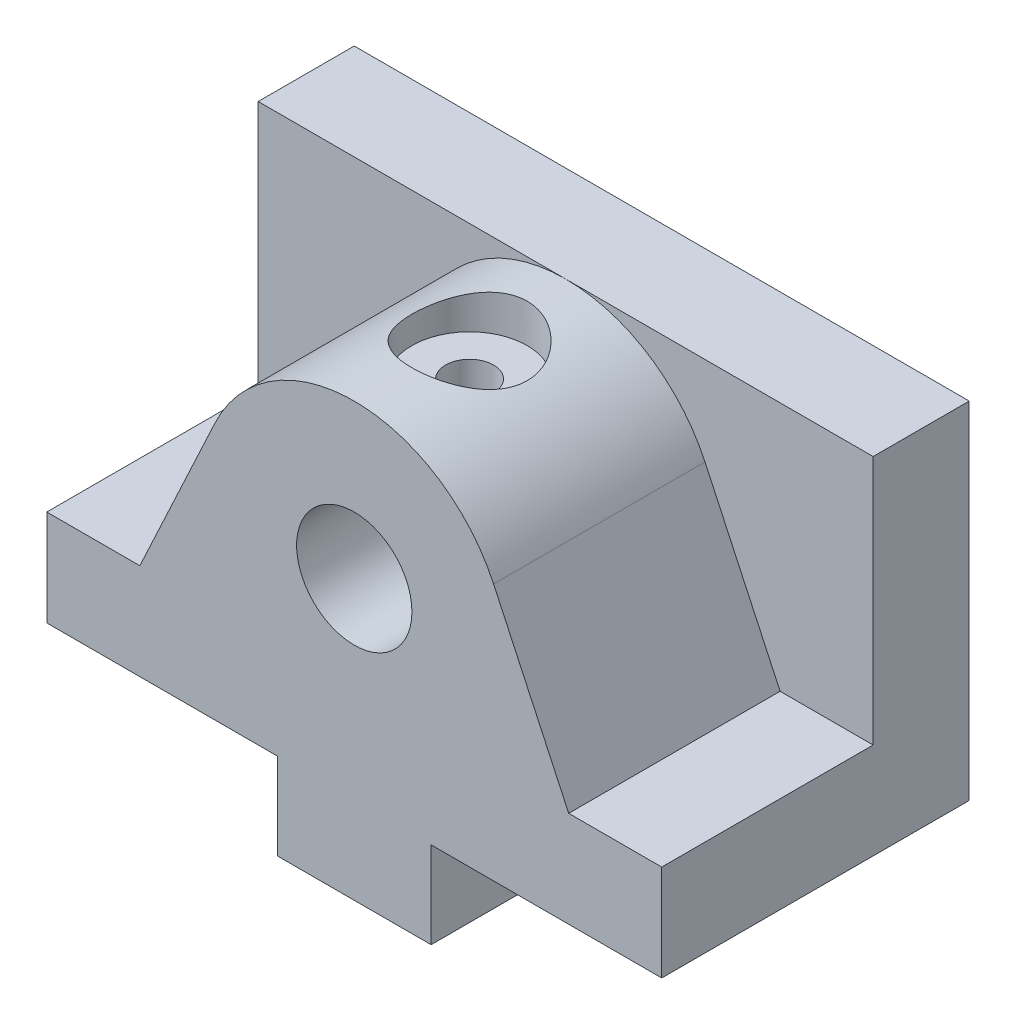
ISO-10303-21;
HEADER;
FILE_DESCRIPTION(('STEP AP214'),'2;1');
FILE_NAME('part.step','',(''),(''),'','','');
FILE_SCHEMA(('AUTOMOTIVE_DESIGN { 1 0 10303 214 1 1 1 1 }'));
ENDSEC;
DATA;
#1=APPLICATION_CONTEXT('core data for automotive mechanical design processes');
#2=APPLICATION_PROTOCOL_DEFINITION('international standard','automotive_design',2000,#1);
#3=PRODUCT_CONTEXT('',#1,'mechanical');
#4=PRODUCT('Part','Part','',(#3));
#5=PRODUCT_RELATED_PRODUCT_CATEGORY('part','',(#4));
#6=PRODUCT_DEFINITION_FORMATION('','',#4);
#7=PRODUCT_DEFINITION_CONTEXT('part definition',#1,'design');
#8=PRODUCT_DEFINITION('design','',#6,#7);
#9=PRODUCT_DEFINITION_SHAPE('','',#8);
#10=(LENGTH_UNIT() NAMED_UNIT(*) SI_UNIT(.MILLI.,.METRE.));
#11=(NAMED_UNIT(*) PLANE_ANGLE_UNIT() SI_UNIT($,.RADIAN.));
#12=(NAMED_UNIT(*) SI_UNIT($,.STERADIAN.) SOLID_ANGLE_UNIT());
#13=UNCERTAINTY_MEASURE_WITH_UNIT(LENGTH_MEASURE(1.E-05),#10,'distance_accuracy_value','');
#14=(GEOMETRIC_REPRESENTATION_CONTEXT(3) GLOBAL_UNCERTAINTY_ASSIGNED_CONTEXT((#13)) GLOBAL_UNIT_ASSIGNED_CONTEXT((#10,
#11,#12)) REPRESENTATION_CONTEXT('',''));
#15=CARTESIAN_POINT('',(0.,0.,0.));
#16=DIRECTION('',(0.,0.,1.));
#17=DIRECTION('',(1.,0.,0.));
#18=AXIS2_PLACEMENT_3D('',#15,#16,#17);
#19=CARTESIAN_POINT('',(0.,45.,20.));
#20=DIRECTION('',(0.,1.,0.));
#21=DIRECTION('',(0.,0.,1.));
#22=AXIS2_PLACEMENT_3D('',#19,#20,#21);
#23=CYLINDRICAL_SURFACE('',#22,2.49999999999999);
#24=CARTESIAN_POINT('',(0.,35.,22.5));
#25=CARTESIAN_POINT('',(0.13390391816379,34.9999962829091,22.4999952878604));
#26=CARTESIAN_POINT('',(0.268039524991423,34.9954665682116,22.4891786843995));
#27=CARTESIAN_POINT('',(0.532498019991111,34.9778011578862,22.4463192619064));
#28=CARTESIAN_POINT('',(0.662810029808667,34.9646430059979,22.4142210532185));
#29=CARTESIAN_POINT('',(0.915376593299221,34.9311262910601,22.3301785119407));
#30=CARTESIAN_POINT('',(1.03765681434384,34.9107921364203,22.2783014076769));
#31=CARTESIAN_POINT('',(1.27165974779732,34.8649055925345,22.1564541669781));
#32=CARTESIAN_POINT('',(1.38338564416287,34.8393547844135,22.0864895110252));
#33=CARTESIAN_POINT('',(1.59889674004596,34.7841566061986,21.9267420881924));
#34=CARTESIAN_POINT('',(1.70208251703041,34.7543750770343,21.8361973967483));
#35=CARTESIAN_POINT('',(1.89231966019709,34.6946542708523,21.6394713160995));
#36=CARTESIAN_POINT('',(1.97936253123989,34.6647149192556,21.5332817462849));
#37=CARTESIAN_POINT('',(2.13907474876482,34.6064204392822,21.3019464489895));
#38=CARTESIAN_POINT('',(2.21082616169409,34.578215738276,21.1761251042486));
#39=CARTESIAN_POINT('',(2.33187881316099,34.5287114463322,20.9128534830571));
#40=CARTESIAN_POINT('',(2.38119161708798,34.507408299805,20.7754092407429));
#41=CARTESIAN_POINT('',(2.45349196589844,34.4755711079554,20.4996926167385));
#42=CARTESIAN_POINT('',(2.47763315746,34.4645677530895,20.361779033289));
#43=CARTESIAN_POINT('',(2.50250419944797,34.4532265243363,20.0834534145536));
#44=CARTESIAN_POINT('',(2.50324696111169,34.4528827684913,19.9430427999296));
#45=CARTESIAN_POINT('',(2.48216900725154,34.4625023912299,19.6751998791476));
#46=CARTESIAN_POINT('',(2.46207362224013,34.4716776544759,19.5475978068758));
#47=CARTESIAN_POINT('',(2.4027838203214,34.4979696554725,19.2977758179945));
#48=CARTESIAN_POINT('',(2.36358574574512,34.5150879140703,19.1755569370152));
#49=CARTESIAN_POINT('',(2.26643917454978,34.5557236954561,18.9368845940184));
#50=CARTESIAN_POINT('',(2.20810943078427,34.579369638983,18.8206091581736));
#51=CARTESIAN_POINT('',(2.07462485161168,34.6303666228215,18.5990445322394));
#52=CARTESIAN_POINT('',(1.9994633810392,34.6577191225955,18.4937596987729));
#53=CARTESIAN_POINT('',(1.82699193108753,34.7158595375597,18.2878000825344));
#54=CARTESIAN_POINT('',(1.72834696641501,34.7467424280895,18.1882668652292));
#55=CARTESIAN_POINT('',(1.51545918210305,34.8065134622506,18.0067729940816));
#56=CARTESIAN_POINT('',(1.40121271889692,34.8354011375402,17.9248164566156));
#57=CARTESIAN_POINT('',(1.15689589738674,34.8887656711295,17.7791283527675));
#58=CARTESIAN_POINT('',(1.02652116489535,34.9131253308667,17.7158611096986));
#59=CARTESIAN_POINT('',(0.755704805053663,34.9537896282961,17.6125577207935));
#60=CARTESIAN_POINT('',(0.615268789590068,34.970098716916,17.5725087361124));
#61=CARTESIAN_POINT('',(0.337856226692454,34.9919928237277,17.5191680157467));
#62=CARTESIAN_POINT('',(0.201222570557276,34.9981908209425,17.5043442851125));
#63=CARTESIAN_POINT('',(-0.0727093109921786,35.0011210073749,17.4973075527718));
#64=CARTESIAN_POINT('',(-0.21000733430527,34.9978559142388,17.505088059496));
#65=CARTESIAN_POINT('',(-0.47419648468287,34.9826243531388,17.5419421696121));
#66=CARTESIAN_POINT('',(-0.601265933278774,34.9710977456798,17.5699399081944));
#67=CARTESIAN_POINT('',(-0.848765497942176,34.9409721354483,17.6449363890816));
#68=CARTESIAN_POINT('',(-0.969194773036709,34.9223722391941,17.6919375319006));
#69=CARTESIAN_POINT('',(-1.20421799973828,34.8791654129033,17.8051419514242));
#70=CARTESIAN_POINT('',(-1.31851447371068,34.8543898293856,17.871896366292));
#71=CARTESIAN_POINT('',(-1.53469243246282,34.8014760915818,18.0221067555834));
#72=CARTESIAN_POINT('',(-1.63656870520374,34.7733365353747,18.1055697030587));
#73=CARTESIAN_POINT('',(-1.83266686054867,34.7142417579087,18.2938064665447));
#74=CARTESIAN_POINT('',(-1.92582139596022,34.6832290318203,18.3996770059721));
#75=CARTESIAN_POINT('',(-2.09333969221046,34.6236867353604,18.6260425518712));
#76=CARTESIAN_POINT('',(-2.16769918571026,34.5951577298699,18.746540870345));
#77=CARTESIAN_POINT('',(-2.29631920417609,34.5436277248786,19.0012283506036));
#78=CARTESIAN_POINT('',(-2.3502783647545,34.520711251098,19.1355880710238));
#79=CARTESIAN_POINT('',(-2.43434827902352,34.4841671131833,19.4127411876261));
#80=CARTESIAN_POINT('',(-2.46447869724416,34.4705317911307,19.5555275249888));
#81=CARTESIAN_POINT('',(-2.49808160700531,34.4552632907308,19.8336373983781));
#82=CARTESIAN_POINT('',(-2.50342760836083,34.4527870192911,19.9686893245119));
#83=CARTESIAN_POINT('',(-2.49231151038,34.4578770602726,20.2376857223555));
#84=CARTESIAN_POINT('',(-2.47585275892878,34.4654418310001,20.3716303609001));
#85=CARTESIAN_POINT('',(-2.42316809595843,34.4889910258604,20.6281854946778));
#86=CARTESIAN_POINT('',(-2.38789807270202,34.5045670962545,20.7510333459775));
#87=CARTESIAN_POINT('',(-2.29952656276962,34.542063624659,20.989096043664));
#88=CARTESIAN_POINT('',(-2.24642006560088,34.5639858651503,21.104308734336));
#89=CARTESIAN_POINT('',(-2.12020572373919,34.6133390885325,21.331391788147));
#90=CARTESIAN_POINT('',(-2.04608723750135,34.6410220440408,21.4426446459478));
#91=CARTESIAN_POINT('',(-1.88136812596237,34.6980737913131,21.6517202931151));
#92=CARTESIAN_POINT('',(-1.79076178563714,34.7274431652004,21.7495384050324));
#93=CARTESIAN_POINT('',(-1.58780416898837,34.7871278159309,21.9362973056175));
#94=CARTESIAN_POINT('',(-1.47434977868812,34.8173561917501,22.0240726428278));
#95=CARTESIAN_POINT('',(-1.23319985958042,34.8732030309982,22.1793991300421));
#96=CARTESIAN_POINT('',(-1.10549787741689,34.8988193916017,22.2469410639968));
#97=CARTESIAN_POINT('',(-0.841465213422189,34.9421830837889,22.3584188704516));
#98=CARTESIAN_POINT('',(-0.705312056415863,34.9600534904466,22.4027264942901));
#99=CARTESIAN_POINT('',(-0.426816782070265,34.9864223497589,22.4674156875296));
#100=CARTESIAN_POINT('',(-0.284495506121987,34.9949501404242,22.4878721682058));
#101=CARTESIAN_POINT('',(-0.118052512349435,34.9988856661429,22.4973238417862));
#102=CARTESIAN_POINT('',(-0.0944569348794005,34.99930292615,22.498326602503));
#103=CARTESIAN_POINT('',(-0.0472433090693347,34.9998604213866,22.4996650982568));
#104=CARTESIAN_POINT('',(-0.0236252606651497,35.0000006558228,22.5000008313836));
#105=CARTESIAN_POINT('',(0.,35.,22.5));
#106=B_SPLINE_CURVE_WITH_KNOTS('',3,(#24,#25,#26,#27,#28,#29,#30,#31,#32,#33,#34,#35,#36,#37,
#38,#39,#40,#41,#42,#43,#44,#45,#46,#47,#48,#49,#50,#51,#52,#53,#54,#55,#56,#57,#58,#59,#60,#61,
#62,#63,#64,#65,#66,#67,#68,#69,#70,#71,#72,#73,#74,#75,#76,#77,#78,#79,#80,#81,#82,#83,#84,#85,
#86,#87,#88,#89,#90,#91,#92,#93,#94,#95,#96,#97,#98,#99,#100,#101,#102,#103,#104,#105),
.UNSPECIFIED.,.T.,.F.,(4,2,2,2,2,2,2,2,2,2,2,2,2,2,2,2,2,2,2,2,2,2,2,2,2,2,2,2,2,2,2,2,2,2,2,2,
2,2,2,2,4),(0.,0.401613837767876,0.804277081257389,1.2055837038126,1.60676887370594,
2.02635872577613,2.4461687626293,2.88663449078249,3.32687293461174,3.74590546275114,
4.16470676498091,4.55140314405112,4.93817359454424,5.33317426117427,5.72833091434411,
6.15688282255791,6.58553498629174,7.02408110121624,7.46238448436591,7.87296886786499,
8.28343534986341,8.6735317947144,9.06367753203567,9.46594270544319,9.86837610938989,
10.2995697605859,10.7308612248068,11.1682957671904,11.6053689414916,12.0087975511928,
12.4121642259507,12.7967529992952,13.1814498990122,13.5892778679488,13.9972474685188,
14.4349307000977,14.8728129885716,15.3034571163877,15.7327450093864,15.8036033125921,
15.8744618187068),.UNSPECIFIED.);
#107=CARTESIAN_POINT('',(0.,35.,22.5));
#108=VERTEX_POINT('',#107);
#109=EDGE_CURVE('E154',#108,#108,#106,.T.);
#110=ORIENTED_EDGE('',*,*,#109,.F.);
#111=EDGE_LOOP('',(#110));
#112=FACE_BOUND('',#111,.T.);
#113=CARTESIAN_POINT('',(0.,41.,20.));
#114=DIRECTION('',(0.,1.,0.));
#115=DIRECTION('',(0.,0.,1.));
#116=AXIS2_PLACEMENT_3D('',#113,#114,#115);
#117=CIRCLE('',#116,2.49999999999999);
#118=CARTESIAN_POINT('',(0.,41.,22.5));
#119=VERTEX_POINT('',#118);
#120=EDGE_CURVE('E162',#119,#119,#117,.F.);
#121=ORIENTED_EDGE('',*,*,#120,.F.);
#122=EDGE_LOOP('',(#121));
#123=FACE_BOUND('',#122,.T.);
#124=ADVANCED_FACE('F34',(#112,#123),#23,.F.);
#125=CARTESIAN_POINT('',(0.,0.,10.));
#126=DIRECTION('',(0.,0.,-1.));
#127=DIRECTION('',(-1.,0.,0.));
#128=AXIS2_PLACEMENT_3D('',#125,#126,#127);
#129=PLANE('',#128);
#130=DIRECTION('',(0.422618261740697,-0.906307787036651,0.));
#131=VECTOR('',#130,1.);
#132=CARTESIAN_POINT('',(25.6085690178115,11.9414718473963,10.));
#133=LINE('',#132,#131);
#134=CARTESIAN_POINT('',(14.5009245925864,35.7618921878512,10.));
#135=VERTEX_POINT('',#134);
#136=CARTESIAN_POINT('',(22.3171232849498,19.,10.));
#137=VERTEX_POINT('',#136);
#138=EDGE_CURVE('E218',#135,#137,#133,.T.);
#139=ORIENTED_EDGE('',*,*,#138,.T.);
#140=DIRECTION('',(1.,0.,0.));
#141=VECTOR('',#140,1.);
#142=CARTESIAN_POINT('',(0.,19.,10.));
#143=LINE('',#142,#141);
#144=CARTESIAN_POINT('',(32.,19.,10.));
#145=VERTEX_POINT('',#144);
#146=EDGE_CURVE('E259',#137,#145,#143,.T.);
#147=ORIENTED_EDGE('',*,*,#146,.T.);
#148=DIRECTION('',(0.,1.,0.));
#149=VECTOR('',#148,1.);
#150=CARTESIAN_POINT('',(32.,9.,10.));
#151=LINE('',#150,#149);
#152=CARTESIAN_POINT('',(32.,45.,10.));
#153=VERTEX_POINT('',#152);
#154=EDGE_CURVE('E276',#145,#153,#151,.T.);
#155=ORIENTED_EDGE('',*,*,#154,.T.);
#156=DIRECTION('',(-1.,0.,0.));
#157=VECTOR('',#156,1.);
#158=CARTESIAN_POINT('',(-32.,45.,10.));
#159=LINE('',#158,#157);
#160=CARTESIAN_POINT('',(0.,45.,10.));
#161=VERTEX_POINT('',#160);
#162=EDGE_CURVE('E113',#153,#161,#159,.T.);
#163=ORIENTED_EDGE('',*,*,#162,.T.);
#164=CARTESIAN_POINT('',(0.,29.,10.));
#165=DIRECTION('',(0.,0.,1.));
#166=DIRECTION('',(1.,0.,0.));
#167=AXIS2_PLACEMENT_3D('',#164,#165,#166);
#168=CIRCLE('',#167,16.);
#169=EDGE_CURVE('E47',#161,#135,#168,.F.);
#170=ORIENTED_EDGE('',*,*,#169,.T.);
#171=EDGE_LOOP('',(#139,#147,#155,#163,#170));
#172=FACE_BOUND('',#171,.T.);
#173=ADVANCED_FACE('F170',(#172),#129,.F.);
#174=CARTESIAN_POINT('',(-32.,9.,10.));
#175=DIRECTION('',(1.,0.,0.));
#176=DIRECTION('',(0.,0.,-1.));
#177=AXIS2_PLACEMENT_3D('',#174,#175,#176);
#178=PLANE('',#177);
#179=DIRECTION('',(0.,-1.,0.));
#180=VECTOR('',#179,1.);
#181=CARTESIAN_POINT('',(-32.,9.,0.));
#182=LINE('',#181,#180);
#183=CARTESIAN_POINT('',(-32.,45.,0.));
#184=VERTEX_POINT('',#183);
#185=CARTESIAN_POINT('',(-32.,9.,0.));
#186=VERTEX_POINT('',#185);
#187=EDGE_CURVE('E111',#184,#186,#182,.T.);
#188=ORIENTED_EDGE('',*,*,#187,.T.);
#189=DIRECTION('',(0.,0.,-1.));
#190=VECTOR('',#189,1.);
#191=CARTESIAN_POINT('',(-32.,9.,10.));
#192=LINE('',#191,#190);
#193=CARTESIAN_POINT('',(-32.,9.,32.));
#194=VERTEX_POINT('',#193);
#195=EDGE_CURVE('E152',#194,#186,#192,.T.);
#196=ORIENTED_EDGE('',*,*,#195,.F.);
#197=DIRECTION('',(0.,-1.,0.));
#198=VECTOR('',#197,1.);
#199=CARTESIAN_POINT('',(-32.,0.,32.));
#200=LINE('',#199,#198);
#201=CARTESIAN_POINT('',(-32.,19.,32.));
#202=VERTEX_POINT('',#201);
#203=EDGE_CURVE('E224',#202,#194,#200,.T.);
#204=ORIENTED_EDGE('',*,*,#203,.F.);
#205=DIRECTION('',(0.,0.,-1.));
#206=VECTOR('',#205,1.);
#207=CARTESIAN_POINT('',(-32.,19.,32.));
#208=LINE('',#207,#206);
#209=CARTESIAN_POINT('',(-32.,19.,10.));
#210=VERTEX_POINT('',#209);
#211=EDGE_CURVE('E272',#202,#210,#208,.T.);
#212=ORIENTED_EDGE('',*,*,#211,.T.);
#213=DIRECTION('',(0.,-1.,0.));
#214=VECTOR('',#213,1.);
#215=CARTESIAN_POINT('',(-32.,9.,10.));
#216=LINE('',#215,#214);
#217=CARTESIAN_POINT('',(-32.,45.,10.));
#218=VERTEX_POINT('',#217);
#219=EDGE_CURVE('E105',#218,#210,#216,.T.);
#220=ORIENTED_EDGE('',*,*,#219,.F.);
#221=DIRECTION('',(0.,0.,-1.));
#222=VECTOR('',#221,1.);
#223=CARTESIAN_POINT('',(-32.,45.,10.));
#224=LINE('',#223,#222);
#225=EDGE_CURVE('E97',#218,#184,#224,.T.);
#226=ORIENTED_EDGE('',*,*,#225,.T.);
#227=EDGE_LOOP('',(#188,#196,#204,#212,#220,#226));
#228=FACE_BOUND('',#227,.T.);
#229=ADVANCED_FACE('F36',(#228),#178,.F.);
#230=CARTESIAN_POINT('',(-32.,9.,10.));
#231=DIRECTION('',(0.,1.,0.));
#232=DIRECTION('',(-1.,0.,0.));
#233=AXIS2_PLACEMENT_3D('',#230,#231,#232);
#234=PLANE('',#233);
#235=DIRECTION('',(1.,0.,0.));
#236=VECTOR('',#235,1.);
#237=CARTESIAN_POINT('',(-32.,9.,0.));
#238=LINE('',#237,#236);
#239=CARTESIAN_POINT('',(-8.,9.00000000000001,0.));
#240=VERTEX_POINT('',#239);
#241=EDGE_CURVE('E117',#186,#240,#238,.T.);
#242=ORIENTED_EDGE('',*,*,#241,.T.);
#243=DIRECTION('',(0.,0.,-1.));
#244=VECTOR('',#243,1.);
#245=CARTESIAN_POINT('',(-8.,9.00000000000001,10.));
#246=LINE('',#245,#244);
#247=CARTESIAN_POINT('',(-8.,9.00000000000001,32.));
#248=VERTEX_POINT('',#247);
#249=EDGE_CURVE('E149',#248,#240,#246,.T.);
#250=ORIENTED_EDGE('',*,*,#249,.F.);
#251=DIRECTION('',(1.,0.,0.));
#252=VECTOR('',#251,1.);
#253=CARTESIAN_POINT('',(0.,9.00000000000001,32.));
#254=LINE('',#253,#252);
#255=EDGE_CURVE('E227',#194,#248,#254,.T.);
#256=ORIENTED_EDGE('',*,*,#255,.F.);
#257=ORIENTED_EDGE('',*,*,#195,.T.);
#258=EDGE_LOOP('',(#242,#250,#256,#257));
#259=FACE_BOUND('',#258,.T.);
#260=ADVANCED_FACE('F392',(#259),#234,.F.);
#261=CARTESIAN_POINT('',(-8.,9.00000000000001,10.));
#262=DIRECTION('',(1.,0.,0.));
#263=DIRECTION('',(0.,0.,-1.));
#264=AXIS2_PLACEMENT_3D('',#261,#262,#263);
#265=PLANE('',#264);
#266=DIRECTION('',(0.,-1.,0.));
#267=VECTOR('',#266,1.);
#268=CARTESIAN_POINT('',(-8.,9.00000000000001,0.));
#269=LINE('',#268,#267);
#270=CARTESIAN_POINT('',(-8.,0.,0.));
#271=VERTEX_POINT('',#270);
#272=EDGE_CURVE('E121',#240,#271,#269,.T.);
#273=ORIENTED_EDGE('',*,*,#272,.T.);
#274=DIRECTION('',(0.,0.,-1.));
#275=VECTOR('',#274,1.);
#276=CARTESIAN_POINT('',(-8.,0.,10.));
#277=LINE('',#276,#275);
#278=CARTESIAN_POINT('',(-8.,0.,32.));
#279=VERTEX_POINT('',#278);
#280=EDGE_CURVE('E146',#279,#271,#277,.T.);
#281=ORIENTED_EDGE('',*,*,#280,.F.);
#282=DIRECTION('',(0.,-1.,0.));
#283=VECTOR('',#282,1.);
#284=CARTESIAN_POINT('',(-8.,0.,32.));
#285=LINE('',#284,#283);
#286=EDGE_CURVE('E230',#248,#279,#285,.T.);
#287=ORIENTED_EDGE('',*,*,#286,.F.);
#288=ORIENTED_EDGE('',*,*,#249,.T.);
#289=EDGE_LOOP('',(#273,#281,#287,#288));
#290=FACE_BOUND('',#289,.T.);
#291=ADVANCED_FACE('F389',(#290),#265,.F.);
#292=CARTESIAN_POINT('',(-8.,0.,10.));
#293=DIRECTION('',(0.,1.,0.));
#294=DIRECTION('',(-1.,0.,0.));
#295=AXIS2_PLACEMENT_3D('',#292,#293,#294);
#296=PLANE('',#295);
#297=CARTESIAN_POINT('',(0.,0.,8.));
#298=DIRECTION('',(0.,-1.,0.));
#299=DIRECTION('',(0.,0.,-1.));
#300=AXIS2_PLACEMENT_3D('',#297,#298,#299);
#301=CIRCLE('',#300,2.5);
#302=CARTESIAN_POINT('',(0.,0.,5.5));
#303=VERTEX_POINT('',#302);
#304=EDGE_CURVE('E161',#303,#303,#301,.T.);
#305=ORIENTED_EDGE('',*,*,#304,.F.);
#306=EDGE_LOOP('',(#305));
#307=FACE_BOUND('',#306,.T.);
#308=CARTESIAN_POINT('',(0.,0.,24.));
#309=DIRECTION('',(0.,-1.,0.));
#310=DIRECTION('',(0.,0.,-1.));
#311=AXIS2_PLACEMENT_3D('',#308,#309,#310);
#312=CIRCLE('',#311,2.5);
#313=CARTESIAN_POINT('',(0.,0.,21.5));
#314=VERTEX_POINT('',#313);
#315=EDGE_CURVE('E202',#314,#314,#312,.T.);
#316=ORIENTED_EDGE('',*,*,#315,.F.);
#317=EDGE_LOOP('',(#316));
#318=FACE_BOUND('',#317,.T.);
#319=DIRECTION('',(1.,0.,0.));
#320=VECTOR('',#319,1.);
#321=CARTESIAN_POINT('',(-8.,0.,0.));
#322=LINE('',#321,#320);
#323=CARTESIAN_POINT('',(8.,0.,0.));
#324=VERTEX_POINT('',#323);
#325=EDGE_CURVE('E129',#271,#324,#322,.T.);
#326=ORIENTED_EDGE('',*,*,#325,.T.);
#327=DIRECTION('',(0.,0.,-1.));
#328=VECTOR('',#327,1.);
#329=CARTESIAN_POINT('',(8.,0.,10.));
#330=LINE('',#329,#328);
#331=CARTESIAN_POINT('',(8.,0.,32.));
#332=VERTEX_POINT('',#331);
#333=EDGE_CURVE('E143',#332,#324,#330,.T.);
#334=ORIENTED_EDGE('',*,*,#333,.F.);
#335=DIRECTION('',(1.,0.,0.));
#336=VECTOR('',#335,1.);
#337=CARTESIAN_POINT('',(0.,0.,32.));
#338=LINE('',#337,#336);
#339=EDGE_CURVE('E233',#279,#332,#338,.T.);
#340=ORIENTED_EDGE('',*,*,#339,.F.);
#341=ORIENTED_EDGE('',*,*,#280,.T.);
#342=EDGE_LOOP('',(#326,#334,#340,#341));
#343=FACE_BOUND('',#342,.T.);
#344=ADVANCED_FACE('F385',(#307,#318,#343),#296,.F.);
#345=CARTESIAN_POINT('',(8.,9.,10.));
#346=DIRECTION('',(-1.,0.,0.));
#347=DIRECTION('',(0.,-1.,0.));
#348=AXIS2_PLACEMENT_3D('',#345,#346,#347);
#349=PLANE('',#348);
#350=DIRECTION('',(0.,1.,0.));
#351=VECTOR('',#350,1.);
#352=CARTESIAN_POINT('',(8.,9.,0.));
#353=LINE('',#352,#351);
#354=CARTESIAN_POINT('',(8.,9.,0.));
#355=VERTEX_POINT('',#354);
#356=EDGE_CURVE('E131',#324,#355,#353,.T.);
#357=ORIENTED_EDGE('',*,*,#356,.T.);
#358=DIRECTION('',(0.,0.,-1.));
#359=VECTOR('',#358,1.);
#360=CARTESIAN_POINT('',(8.,9.,10.));
#361=LINE('',#360,#359);
#362=CARTESIAN_POINT('',(8.,9.,32.));
#363=VERTEX_POINT('',#362);
#364=EDGE_CURVE('E140',#363,#355,#361,.T.);
#365=ORIENTED_EDGE('',*,*,#364,.F.);
#366=DIRECTION('',(0.,1.,0.));
#367=VECTOR('',#366,1.);
#368=CARTESIAN_POINT('',(8.,0.,32.));
#369=LINE('',#368,#367);
#370=EDGE_CURVE('E236',#332,#363,#369,.T.);
#371=ORIENTED_EDGE('',*,*,#370,.F.);
#372=ORIENTED_EDGE('',*,*,#333,.T.);
#373=EDGE_LOOP('',(#357,#365,#371,#372));
#374=FACE_BOUND('',#373,.T.);
#375=ADVANCED_FACE('F381',(#374),#349,.F.);
#376=CARTESIAN_POINT('',(8.,9.,10.));
#377=DIRECTION('',(0.,1.,0.));
#378=DIRECTION('',(-1.,0.,0.));
#379=AXIS2_PLACEMENT_3D('',#376,#377,#378);
#380=PLANE('',#379);
#381=DIRECTION('',(1.,0.,0.));
#382=VECTOR('',#381,1.);
#383=CARTESIAN_POINT('',(8.,9.,0.));
#384=LINE('',#383,#382);
#385=CARTESIAN_POINT('',(32.,9.,0.));
#386=VERTEX_POINT('',#385);
#387=EDGE_CURVE('E133',#355,#386,#384,.T.);
#388=ORIENTED_EDGE('',*,*,#387,.T.);
#389=DIRECTION('',(0.,0.,-1.));
#390=VECTOR('',#389,1.);
#391=CARTESIAN_POINT('',(32.,9.,10.));
#392=LINE('',#391,#390);
#393=CARTESIAN_POINT('',(32.,9.,32.));
#394=VERTEX_POINT('',#393);
#395=EDGE_CURVE('E137',#394,#386,#392,.T.);
#396=ORIENTED_EDGE('',*,*,#395,.F.);
#397=DIRECTION('',(1.,0.,0.));
#398=VECTOR('',#397,1.);
#399=CARTESIAN_POINT('',(0.,9.,32.));
#400=LINE('',#399,#398);
#401=EDGE_CURVE('E239',#363,#394,#400,.T.);
#402=ORIENTED_EDGE('',*,*,#401,.F.);
#403=ORIENTED_EDGE('',*,*,#364,.T.);
#404=EDGE_LOOP('',(#388,#396,#402,#403));
#405=FACE_BOUND('',#404,.T.);
#406=ADVANCED_FACE('F377',(#405),#380,.F.);
#407=CARTESIAN_POINT('',(32.,9.,10.));
#408=DIRECTION('',(-1.,0.,0.));
#409=DIRECTION('',(0.,0.,1.));
#410=AXIS2_PLACEMENT_3D('',#407,#408,#409);
#411=PLANE('',#410);
#412=DIRECTION('',(0.,1.,0.));
#413=VECTOR('',#412,1.);
#414=CARTESIAN_POINT('',(32.,9.,0.));
#415=LINE('',#414,#413);
#416=CARTESIAN_POINT('',(32.,45.,0.));
#417=VERTEX_POINT('',#416);
#418=EDGE_CURVE('E106',#386,#417,#415,.T.);
#419=ORIENTED_EDGE('',*,*,#418,.T.);
#420=DIRECTION('',(0.,0.,-1.));
#421=VECTOR('',#420,1.);
#422=CARTESIAN_POINT('',(32.,45.,10.));
#423=LINE('',#422,#421);
#424=EDGE_CURVE('E101',#153,#417,#423,.T.);
#425=ORIENTED_EDGE('',*,*,#424,.F.);
#426=ORIENTED_EDGE('',*,*,#154,.F.);
#427=DIRECTION('',(0.,0.,-1.));
#428=VECTOR('',#427,1.);
#429=CARTESIAN_POINT('',(32.,19.,32.));
#430=LINE('',#429,#428);
#431=CARTESIAN_POINT('',(32.,19.,32.));
#432=VERTEX_POINT('',#431);
#433=EDGE_CURVE('E269',#432,#145,#430,.T.);
#434=ORIENTED_EDGE('',*,*,#433,.F.);
#435=DIRECTION('',(0.,1.,0.));
#436=VECTOR('',#435,1.);
#437=CARTESIAN_POINT('',(32.,0.,32.));
#438=LINE('',#437,#436);
#439=EDGE_CURVE('E242',#394,#432,#438,.T.);
#440=ORIENTED_EDGE('',*,*,#439,.F.);
#441=ORIENTED_EDGE('',*,*,#395,.T.);
#442=EDGE_LOOP('',(#419,#425,#426,#434,#440,#441));
#443=FACE_BOUND('',#442,.T.);
#444=ADVANCED_FACE('F374',(#443),#411,.F.);
#445=CARTESIAN_POINT('',(-32.,45.,10.));
#446=DIRECTION('',(0.,-1.,0.));
#447=DIRECTION('',(0.,0.,-1.));
#448=AXIS2_PLACEMENT_3D('',#445,#446,#447);
#449=PLANE('',#448);
#450=DIRECTION('',(-1.,0.,0.));
#451=VECTOR('',#450,1.);
#452=CARTESIAN_POINT('',(-32.,45.,0.));
#453=LINE('',#452,#451);
#454=EDGE_CURVE('E94',#417,#184,#453,.T.);
#455=ORIENTED_EDGE('',*,*,#454,.T.);
#456=ORIENTED_EDGE('',*,*,#225,.F.);
#457=EDGE_CURVE('E62',#161,#218,#159,.T.);
#458=ORIENTED_EDGE('',*,*,#457,.F.);
#459=ORIENTED_EDGE('',*,*,#162,.F.);
#460=ORIENTED_EDGE('',*,*,#424,.T.);
#461=EDGE_LOOP('',(#455,#456,#458,#459,#460));
#462=FACE_BOUND('',#461,.T.);
#463=ADVANCED_FACE('F96',(#462),#449,.F.);
#464=DIRECTION('',(0.422618261740697,0.906307787036651,0.));
#465=VECTOR('',#464,1.);
#466=CARTESIAN_POINT('',(-25.6085690178115,11.9414718473963,10.));
#467=LINE('',#466,#465);
#468=CARTESIAN_POINT('',(-22.3171232849498,19.,10.));
#469=VERTEX_POINT('',#468);
#470=CARTESIAN_POINT('',(-14.5009245925864,35.7618921878512,10.));
#471=VERTEX_POINT('',#470);
#472=EDGE_CURVE('E253',#469,#471,#467,.T.);
#473=ORIENTED_EDGE('',*,*,#472,.T.);
#474=EDGE_CURVE('E54',#471,#161,#168,.F.);
#475=ORIENTED_EDGE('',*,*,#474,.T.);
#476=ORIENTED_EDGE('',*,*,#457,.T.);
#477=ORIENTED_EDGE('',*,*,#219,.T.);
#478=DIRECTION('',(1.,0.,0.));
#479=VECTOR('',#478,1.);
#480=CARTESIAN_POINT('',(0.,19.,10.));
#481=LINE('',#480,#479);
#482=EDGE_CURVE('E256',#210,#469,#481,.T.);
#483=ORIENTED_EDGE('',*,*,#482,.T.);
#484=EDGE_LOOP('',(#473,#475,#476,#477,#483));
#485=FACE_BOUND('',#484,.T.);
#486=ADVANCED_FACE('F365',(#485),#129,.F.);
#487=CARTESIAN_POINT('',(0.,0.,0.));
#488=DIRECTION('',(0.,0.,-1.));
#489=DIRECTION('',(-1.,0.,0.));
#490=AXIS2_PLACEMENT_3D('',#487,#488,#489);
#491=PLANE('',#490);
#492=ORIENTED_EDGE('',*,*,#187,.F.);
#493=ORIENTED_EDGE('',*,*,#454,.F.);
#494=ORIENTED_EDGE('',*,*,#418,.F.);
#495=ORIENTED_EDGE('',*,*,#387,.F.);
#496=ORIENTED_EDGE('',*,*,#356,.F.);
#497=ORIENTED_EDGE('',*,*,#325,.F.);
#498=ORIENTED_EDGE('',*,*,#272,.F.);
#499=ORIENTED_EDGE('',*,*,#241,.F.);
#500=EDGE_LOOP('',(#492,#493,#494,#495,#496,#497,#498,#499));
#501=FACE_BOUND('',#500,.T.);
#502=ADVANCED_FACE('F115',(#501),#491,.T.);
#503=CARTESIAN_POINT('',(0.,29.,32.));
#504=DIRECTION('',(0.,0.,-1.));
#505=DIRECTION('',(-1.,0.,0.));
#506=AXIS2_PLACEMENT_3D('',#503,#504,#505);
#507=CYLINDRICAL_SURFACE('',#506,16.);
#508=CARTESIAN_POINT('',(0.,45.,26.));
#509=CARTESIAN_POINT('',(0.162427733217201,45.0000005574365,26.0000007602957));
#510=CARTESIAN_POINT('',(0.324844993204213,44.997521305701,25.9933993080084));
#511=CARTESIAN_POINT('',(0.64852033165105,44.9876715176004,25.9670588748949));
#512=CARTESIAN_POINT('',(0.809777999754457,44.9802993282726,25.9473154543604));
#513=CARTESIAN_POINT('',(1.12979634025998,44.9608661386765,25.8948993463118));
#514=CARTESIAN_POINT('',(1.28855831551786,44.9488076755506,25.862233654727));
#515=CARTESIAN_POINT('',(1.60261141357126,44.920317470945,25.7842738733722));
#516=CARTESIAN_POINT('',(1.75790116237643,44.9038840303219,25.7389748767831));
#517=CARTESIAN_POINT('',(2.06353693603205,44.8671186446933,25.6362882409148));
#518=CARTESIAN_POINT('',(2.21389375159541,44.8467959807585,25.5789293493184));
#519=CARTESIAN_POINT('',(2.50915130568742,44.8027355385636,25.4525186694811));
#520=CARTESIAN_POINT('',(2.6540499966769,44.7789964944816,25.3834625455477));
#521=CARTESIAN_POINT('',(2.93745114452687,44.7287028027287,25.2342168143563));
#522=CARTESIAN_POINT('',(3.0759545431908,44.7021485715472,25.1540288534427));
#523=CARTESIAN_POINT('',(3.3458591786585,44.6468595232441,24.9830470822765));
#524=CARTESIAN_POINT('',(3.47725782650567,44.6181239202831,24.8922494434723));
#525=CARTESIAN_POINT('',(3.73705610176947,44.5580480618583,24.6970003413131));
#526=CARTESIAN_POINT('',(3.86515055841849,44.5266502766543,24.5921603828122));
#527=CARTESIAN_POINT('',(4.11214204970197,44.4630706424826,24.372369869496));
#528=CARTESIAN_POINT('',(4.23103881568697,44.4308887706492,24.2574190195676));
#529=CARTESIAN_POINT('',(4.45900396938853,44.3665649618726,24.0180360373654));
#530=CARTESIAN_POINT('',(4.56806779232923,44.334423050239,23.8935995505131));
#531=CARTESIAN_POINT('',(4.7756151663689,44.2710599351284,23.6360477699149));
#532=CARTESIAN_POINT('',(4.87410227927999,44.2398384242831,23.5029354222708));
#533=CARTESIAN_POINT('',(5.06349317838993,44.1779887662079,23.2234482386464));
#534=CARTESIAN_POINT('',(5.15395768486007,44.1474300063047,23.0767598378184));
#535=CARTESIAN_POINT('',(5.32210766389307,44.0891712380417,22.7757656695402));
#536=CARTESIAN_POINT('',(5.39979826063104,44.0614700850402,22.6214629889649));
#537=CARTESIAN_POINT('',(5.54178841369625,44.0098065930345,22.3061815850797));
#538=CARTESIAN_POINT('',(5.60608640345173,43.9858446915035,22.1452020834008));
#539=CARTESIAN_POINT('',(5.72063465547911,43.9424928843857,21.81780057419));
#540=CARTESIAN_POINT('',(5.77089169343533,43.9231007742832,21.6513812351974));
#541=CARTESIAN_POINT('',(5.85511762079081,43.8902504435595,21.3211525666841));
#542=CARTESIAN_POINT('',(5.88966490620081,43.8765832940335,21.1575115351662));
#543=CARTESIAN_POINT('',(5.94499608898466,43.8545586136563,20.8276330784873));
#544=CARTESIAN_POINT('',(5.96578600537438,43.8461987608635,20.6613968213974));
#545=CARTESIAN_POINT('',(5.99338932391421,43.8350769098856,20.3276054252288));
#546=CARTESIAN_POINT('',(6.00020481754232,43.8323140740252,20.1600504872786));
#547=CARTESIAN_POINT('',(5.99978582609108,43.8324836592826,19.8249644226498));
#548=CARTESIAN_POINT('',(5.99255188597222,43.8354158594969,19.6574332952996));
#549=CARTESIAN_POINT('',(5.9649764539924,43.8465233912792,19.3337968163015));
#550=CARTESIAN_POINT('',(5.94544909811054,43.8543729222115,19.1776100511793));
#551=CARTESIAN_POINT('',(5.89424692585002,43.8747642678532,18.8674991430671));
#552=CARTESIAN_POINT('',(5.86256807516545,43.887307640888,18.713575769166));
#553=CARTESIAN_POINT('',(5.78737202482784,43.9167004061573,18.4091172143364));
#554=CARTESIAN_POINT('',(5.74385788753069,43.9335486844382,18.2585811678383));
#555=CARTESIAN_POINT('',(5.64535023739173,43.9710653122174,17.961744468934));
#556=CARTESIAN_POINT('',(5.59035233353468,43.9917351225968,17.8154454610688));
#557=CARTESIAN_POINT('',(5.46820476177672,44.0367233176973,17.5253353619598));
#558=CARTESIAN_POINT('',(5.40084887641492,44.0611021931745,17.3816205499656));
#559=CARTESIAN_POINT('',(5.25517504141256,44.112547805852,17.1003042179553));
#560=CARTESIAN_POINT('',(5.17685336615087,44.1396154556501,16.9627047966598));
#561=CARTESIAN_POINT('',(5.00978390525085,44.1957174270412,16.6943919957115));
#562=CARTESIAN_POINT('',(4.92103495161993,44.2247519687976,16.5636793898528));
#563=CARTESIAN_POINT('',(4.73365945980357,44.2840480047093,16.3098294804081));
#564=CARTESIAN_POINT('',(4.63503247524755,44.3143095542741,16.1866925195583));
#565=CARTESIAN_POINT('',(4.42148606838323,44.3773753801615,15.9405960938781));
#566=CARTESIAN_POINT('',(4.30591643878468,44.4102134955816,15.8182087348401));
#567=CARTESIAN_POINT('',(4.06489568201331,44.4755357173162,15.5835644456262));
#568=CARTESIAN_POINT('',(3.93944756276282,44.5080199279887,15.4713044539146));
#569=CARTESIAN_POINT('',(3.67930542713133,44.5717902850822,15.2575250220562));
#570=CARTESIAN_POINT('',(3.54460652130529,44.6030757841096,15.156011334964));
#571=CARTESIAN_POINT('',(3.26687700935565,44.6635788517399,14.9645305768333));
#572=CARTESIAN_POINT('',(3.1238497570632,44.6927972424122,14.8745589039352));
#573=CARTESIAN_POINT('',(2.8279450922801,44.7488334975338,14.7054533193311));
#574=CARTESIAN_POINT('',(2.67494692833352,44.7756056227759,14.6265152312545));
#575=CARTESIAN_POINT('',(2.3622882806369,44.8254428006133,14.4819164034619));
#576=CARTESIAN_POINT('',(2.20263047079285,44.8485093233326,14.4162503956301));
#577=CARTESIAN_POINT('',(1.87775996874068,44.8902747413691,14.2987855429824));
#578=CARTESIAN_POINT('',(1.71254812449194,44.9089742999771,14.2469845920514));
#579=CARTESIAN_POINT('',(1.37781252548076,44.941452244328,14.157771941178));
#580=CARTESIAN_POINT('',(1.20828902944486,44.9552309246121,14.1203593800025));
#581=CARTESIAN_POINT('',(0.875397691778056,44.9768584541714,14.0619278732731));
#582=CARTESIAN_POINT('',(0.712181926506239,44.9849836851652,14.0401429194934));
#583=CARTESIAN_POINT('',(0.384342839277857,44.9962238192193,14.0100607040704));
#584=CARTESIAN_POINT('',(0.219719576503011,44.9993389319109,14.001762878104));
#585=CARTESIAN_POINT('',(-0.109636493119359,45.0004717193298,13.9987420610468));
#586=CARTESIAN_POINT('',(-0.274369272946656,44.9984903702625,14.0040164702523));
#587=CARTESIAN_POINT('',(-0.602703878901181,44.9894877259905,14.0280788390199));
#588=CARTESIAN_POINT('',(-0.766305722205484,44.9824665075037,14.0468665928792));
#589=CARTESIAN_POINT('',(-1.08484961913033,44.9639458569047,14.0967737611769));
#590=CARTESIAN_POINT('',(-1.23988188497639,44.9526301176627,14.1273881579238));
#591=CARTESIAN_POINT('',(-1.54675761268309,44.9258052315377,14.2006522674047));
#592=CARTESIAN_POINT('',(-1.69860000629036,44.9102947032516,14.2433059450457));
#593=CARTESIAN_POINT('',(-1.99802063532093,44.8754724865307,14.3402587166151));
#594=CARTESIAN_POINT('',(-2.14560001979059,44.85616183355,14.3945546386368));
#595=CARTESIAN_POINT('',(-2.43569439144994,44.8141987820697,14.5143795188757));
#596=CARTESIAN_POINT('',(-2.5782074312085,44.791545115435,14.579912741373));
#597=CARTESIAN_POINT('',(-2.8613459347381,44.7427421936757,14.7237664053313));
#598=CARTESIAN_POINT('',(-3.00179672915218,44.7165106018511,14.8024026301212));
#599=CARTESIAN_POINT('',(-3.27565209358175,44.6617244709423,14.970494344955));
#600=CARTESIAN_POINT('',(-3.40905422018787,44.6331691349366,15.0599535518729));
#601=CARTESIAN_POINT('',(-3.66805220697512,44.574435140652,15.2490937281988));
#602=CARTESIAN_POINT('',(-3.79364691977775,44.5442562449847,15.3487761943412));
#603=CARTESIAN_POINT('',(-4.03634135503765,44.4830105314732,15.5577490233534));
#604=CARTESIAN_POINT('',(-4.1534407668412,44.4519436812165,15.6670397372519));
#605=CARTESIAN_POINT('',(-4.3850769922395,44.3878643733323,15.9012462491934));
#606=CARTESIAN_POINT('',(-4.49906697777692,44.3548440197118,16.0267014193903));
#607=CARTESIAN_POINT('',(-4.71608180551253,44.2895850482594,16.286879849877));
#608=CARTESIAN_POINT('',(-4.81911014985825,44.2573461833059,16.4216001272622));
#609=CARTESIAN_POINT('',(-5.01360921148213,44.194544233745,16.6996187331016));
#610=CARTESIAN_POINT('',(-5.10507411943373,44.163981995784,16.8429213203449));
#611=CARTESIAN_POINT('',(-5.27567954502638,44.1054737865422,17.137115775784));
#612=CARTESIAN_POINT('',(-5.35482524492546,44.0775267171356,17.2880044172602));
#613=CARTESIAN_POINT('',(-5.50053123003078,44.0249854035085,17.5971899746196));
#614=CARTESIAN_POINT('',(-5.5670312831168,44.0004073538346,17.7555180757644));
#615=CARTESIAN_POINT('',(-5.68634828102296,43.9555845073613,18.0777747839644));
#616=CARTESIAN_POINT('',(-5.73917096081639,43.9353378949951,18.241701010963));
#617=CARTESIAN_POINT('',(-5.8306145608513,43.89987725389,18.5739524334313));
#618=CARTESIAN_POINT('',(-5.86923979289934,43.884661697346,18.7422762766704));
#619=CARTESIAN_POINT('',(-5.93187603774561,43.8598111531835,19.0820249499479));
#620=CARTESIAN_POINT('',(-5.95588806980647,43.8501757763529,19.2534495628502));
#621=CARTESIAN_POINT('',(-5.98795090417701,43.8372746439933,19.5868807948243));
#622=CARTESIAN_POINT('',(-5.99692832454356,43.8336393231868,19.7487846409961));
#623=CARTESIAN_POINT('',(-6.00174553399867,43.8316910415951,20.0728179472346));
#624=CARTESIAN_POINT('',(-5.99758576142358,43.8333779032297,20.2349473995933));
#625=CARTESIAN_POINT('',(-5.9761751326358,43.8420167875277,20.5581793568748));
#626=CARTESIAN_POINT('',(-5.9589255469707,43.8489682991838,20.7192819599373));
#627=CARTESIAN_POINT('',(-5.91152013228679,43.8679043387426,21.0392740885878));
#628=CARTESIAN_POINT('',(-5.88136431225468,43.8798888631408,21.1981636157166));
#629=CARTESIAN_POINT('',(-5.80957518001795,43.9080606391937,21.5077481197264));
#630=CARTESIAN_POINT('',(-5.76832374784491,43.9241071644574,21.65854478767));
#631=CARTESIAN_POINT('',(-5.67433519717346,43.9600952888499,21.9560860749421));
#632=CARTESIAN_POINT('',(-5.62159429697566,43.980038170221,22.1028293421527));
#633=CARTESIAN_POINT('',(-5.50506367949973,44.0232530212263,22.3913315670625));
#634=CARTESIAN_POINT('',(-5.44127561377937,44.0465244931439,22.5330912660025));
#635=CARTESIAN_POINT('',(-5.30311395585866,44.0957729106071,22.8108859791413));
#636=CARTESIAN_POINT('',(-5.22873653386789,44.1217508340634,22.9469188990056));
#637=CARTESIAN_POINT('',(-4.98217098059621,44.2055628910557,23.359141669949));
#638=CARTESIAN_POINT('',(-4.79257489281544,44.2669336680249,23.6244522552249));
#639=CARTESIAN_POINT('',(-4.37331782889985,44.3922641444428,24.1206371984375));
#640=CARTESIAN_POINT('',(-4.14364411917575,44.4562246617369,24.3515005683181));
#641=CARTESIAN_POINT('',(-3.76647526932395,44.5509413309461,24.6736561443509));
#642=CARTESIAN_POINT('',(-3.63140882550665,44.5831105995963,24.7793645354149));
#643=CARTESIAN_POINT('',(-3.35244180363032,44.6454953637792,24.979007788506));
#644=CARTESIAN_POINT('',(-3.2085445417169,44.6757115840734,25.0729470302604));
#645=CARTESIAN_POINT('',(-2.91272701664921,44.7333640871372,25.2483917649241));
#646=CARTESIAN_POINT('',(-2.76080251205563,44.7607988774507,25.3298905943074));
#647=CARTESIAN_POINT('',(-2.45006904842549,44.8120821692567,25.4796800534391));
#648=CARTESIAN_POINT('',(-2.29126304435573,44.8359321907958,25.5479762850096));
#649=CARTESIAN_POINT('',(-1.96075860802516,44.8803154092505,25.6734482490879));
#650=CARTESIAN_POINT('',(-1.78880001796275,44.9006582737851,25.7300080942417));
#651=CARTESIAN_POINT('',(-1.43995213398727,44.9360368992552,25.8274639278399));
#652=CARTESIAN_POINT('',(-1.26306259308868,44.9510723938335,25.8683591301428));
#653=CARTESIAN_POINT('',(-0.905989966629825,44.9753306460174,25.9339800873692));
#654=CARTESIAN_POINT('',(-0.725808299297164,44.9845558486144,25.9587126437559));
#655=CARTESIAN_POINT('',(-0.363746582032714,44.9968898686006,25.9917212463711));
#656=CARTESIAN_POINT('',(-0.181866725985323,44.9999993758507,25.9999991487138));
#657=CARTESIAN_POINT('',(0.,45.,26.));
#658=B_SPLINE_CURVE_WITH_KNOTS('',3,(#508,#509,#510,#511,#512,#513,#514,#515,#516,#517,#518,
#519,#520,#521,#522,#523,#524,#525,#526,#527,#528,#529,#530,#531,#532,#533,#534,#535,#536,#537,
#538,#539,#540,#541,#542,#543,#544,#545,#546,#547,#548,#549,#550,#551,#552,#553,#554,#555,#556,
#557,#558,#559,#560,#561,#562,#563,#564,#565,#566,#567,#568,#569,#570,#571,#572,#573,#574,#575,
#576,#577,#578,#579,#580,#581,#582,#583,#584,#585,#586,#587,#588,#589,#590,#591,#592,#593,#594,
#595,#596,#597,#598,#599,#600,#601,#602,#603,#604,#605,#606,#607,#608,#609,#610,#611,#612,#613,
#614,#615,#616,#617,#618,#619,#620,#621,#622,#623,#624,#625,#626,#627,#628,#629,#630,#631,#632,
#633,#634,#635,#636,#637,#638,#639,#640,#641,#642,#643,#644,#645,#646,#647,#648,#649,#650,#651,
#652,#653,#654,#655,#656,#657),.UNSPECIFIED.,.T.,.F.,(4,2,2,2,2,2,2,2,2,2,2,2,2,2,2,2,2,2,2,2,2,
2,2,2,2,2,2,2,2,2,2,2,2,2,2,2,2,2,2,2,2,2,2,2,2,2,2,2,2,2,2,2,2,2,2,2,2,2,2,2,2,2,2,2,2,2,2,2,2,
2,2,2,2,2,4),(0.,0.48711292204893,0.974390487445855,1.46140460810819,1.94860815080488,
2.43466323215078,2.92089887034217,3.40706267311052,3.89340245529402,4.39827808037434,
4.90316844648054,5.40829200524658,5.91324492166593,6.43768308370422,6.96191035461704,
7.48619891150762,8.01023402589576,8.51299593876265,9.01553774150439,9.5180043259783,
10.0204514207721,10.4926927079049,10.9650909154106,11.4373670069502,11.9098240131363,
12.3910323498091,12.8724045752803,13.3538307722826,13.8352787338993,14.349198117185,
14.8629616167018,15.3769987841633,15.8908303611704,16.4128602626089,16.9346825448756,
17.4564255168104,17.9781372543704,18.4721042492951,18.9660505753119,19.4599022950596,
19.9537464974543,20.4284916754825,20.9033933845505,21.3781658716043,21.8531189235062,
22.3418491774121,22.830747752114,23.3197180063781,23.8087061321625,24.3261847888275,
24.8434976160001,25.3610693105782,25.8784226890544,26.3981817069137,26.9177224336738,
27.4371052437639,27.9564518230364,28.4424210177993,28.9283739978568,29.4142798154817,
29.9001852947674,30.3711334028341,30.8422367558885,31.3132697394161,31.7844735134835,
32.7753369225941,33.7665157271057,34.2894950202014,34.8122791119685,35.3353422501841,
35.8581829648323,36.4038564254464,36.9495572674889,37.4950283229957,38.0404378449012),.UNSPECIFIED.);
#659=CARTESIAN_POINT('',(0.,45.,26.));
#660=VERTEX_POINT('',#659);
#661=EDGE_CURVE('E11',#660,#660,#658,.T.);
#662=ORIENTED_EDGE('',*,*,#661,.F.);
#663=EDGE_LOOP('',(#662));
#664=FACE_BOUND('',#663,.T.);
#665=ORIENTED_EDGE('',*,*,#474,.F.);
#666=DIRECTION('',(0.,0.,-1.));
#667=VECTOR('',#666,1.);
#668=CARTESIAN_POINT('',(-14.5009245925864,35.7618921878512,32.));
#669=LINE('',#668,#667);
#670=CARTESIAN_POINT('',(-14.5009245925864,35.7618921878512,32.));
#671=VERTEX_POINT('',#670);
#672=EDGE_CURVE('E119',#671,#471,#669,.T.);
#673=ORIENTED_EDGE('',*,*,#672,.F.);
#674=CARTESIAN_POINT('',(0.,29.,32.));
#675=DIRECTION('',(0.,0.,1.));
#676=DIRECTION('',(1.,0.,0.));
#677=AXIS2_PLACEMENT_3D('',#674,#675,#676);
#678=CIRCLE('',#677,16.);
#679=CARTESIAN_POINT('',(14.5009245925864,35.7618921878512,32.));
#680=VERTEX_POINT('',#679);
#681=EDGE_CURVE('E214',#671,#680,#678,.F.);
#682=ORIENTED_EDGE('',*,*,#681,.T.);
#683=DIRECTION('',(0.,0.,-1.));
#684=VECTOR('',#683,1.);
#685=CARTESIAN_POINT('',(14.5009245925864,35.7618921878512,32.));
#686=LINE('',#685,#684);
#687=EDGE_CURVE('E251',#680,#135,#686,.T.);
#688=ORIENTED_EDGE('',*,*,#687,.T.);
#689=ORIENTED_EDGE('',*,*,#169,.F.);
#690=EDGE_LOOP('',(#665,#673,#682,#688,#689));
#691=FACE_BOUND('',#690,.T.);
#692=ADVANCED_FACE('F355',(#664,#691),#507,.T.);
#693=CARTESIAN_POINT('',(-25.6085690178115,11.9414718473963,32.));
#694=DIRECTION('',(-0.906307787036651,0.422618261740697,0.));
#695=DIRECTION('',(-0.422618261740697,-0.906307787036651,0.));
#696=AXIS2_PLACEMENT_3D('',#693,#694,#695);
#697=PLANE('',#696);
#698=ORIENTED_EDGE('',*,*,#472,.F.);
#699=DIRECTION('',(0.,0.,-1.));
#700=VECTOR('',#699,1.);
#701=CARTESIAN_POINT('',(-22.3171232849498,19.,32.));
#702=LINE('',#701,#700);
#703=CARTESIAN_POINT('',(-22.3171232849498,19.,32.));
#704=VERTEX_POINT('',#703);
#705=EDGE_CURVE('E123',#704,#469,#702,.T.);
#706=ORIENTED_EDGE('',*,*,#705,.F.);
#707=DIRECTION('',(0.422618261740697,0.906307787036651,0.));
#708=VECTOR('',#707,1.);
#709=CARTESIAN_POINT('',(-25.6085690178115,11.9414718473963,32.));
#710=LINE('',#709,#708);
#711=EDGE_CURVE('E217',#704,#671,#710,.T.);
#712=ORIENTED_EDGE('',*,*,#711,.T.);
#713=ORIENTED_EDGE('',*,*,#672,.T.);
#714=EDGE_LOOP('',(#698,#706,#712,#713));
#715=FACE_BOUND('',#714,.T.);
#716=ADVANCED_FACE('F357',(#715),#697,.T.);
#717=CARTESIAN_POINT('',(0.,19.,32.));
#718=DIRECTION('',(0.,1.,0.));
#719=DIRECTION('',(-1.,0.,0.));
#720=AXIS2_PLACEMENT_3D('',#717,#718,#719);
#721=PLANE('',#720);
#722=ORIENTED_EDGE('',*,*,#482,.F.);
#723=ORIENTED_EDGE('',*,*,#211,.F.);
#724=DIRECTION('',(1.,0.,0.));
#725=VECTOR('',#724,1.);
#726=CARTESIAN_POINT('',(0.,19.,32.));
#727=LINE('',#726,#725);
#728=EDGE_CURVE('E221',#202,#704,#727,.T.);
#729=ORIENTED_EDGE('',*,*,#728,.T.);
#730=ORIENTED_EDGE('',*,*,#705,.T.);
#731=EDGE_LOOP('',(#722,#723,#729,#730));
#732=FACE_BOUND('',#731,.T.);
#733=ADVANCED_FACE('F362',(#732),#721,.T.);
#734=CARTESIAN_POINT('',(0.,19.,32.));
#735=DIRECTION('',(0.,1.,0.));
#736=DIRECTION('',(0.,0.,1.));
#737=AXIS2_PLACEMENT_3D('',#734,#735,#736);
#738=PLANE('',#737);
#739=ORIENTED_EDGE('',*,*,#146,.F.);
#740=DIRECTION('',(0.,0.,-1.));
#741=VECTOR('',#740,1.);
#742=CARTESIAN_POINT('',(22.3171232849498,19.,32.));
#743=LINE('',#742,#741);
#744=CARTESIAN_POINT('',(22.3171232849498,19.,32.));
#745=VERTEX_POINT('',#744);
#746=EDGE_CURVE('E266',#745,#137,#743,.T.);
#747=ORIENTED_EDGE('',*,*,#746,.F.);
#748=DIRECTION('',(1.,0.,0.));
#749=VECTOR('',#748,1.);
#750=CARTESIAN_POINT('',(0.,19.,32.));
#751=LINE('',#750,#749);
#752=EDGE_CURVE('E245',#745,#432,#751,.T.);
#753=ORIENTED_EDGE('',*,*,#752,.T.);
#754=ORIENTED_EDGE('',*,*,#433,.T.);
#755=EDGE_LOOP('',(#739,#747,#753,#754));
#756=FACE_BOUND('',#755,.T.);
#757=ADVANCED_FACE('F427',(#756),#738,.T.);
#758=CARTESIAN_POINT('',(25.6085690178115,11.9414718473963,32.));
#759=DIRECTION('',(0.906307787036651,0.422618261740697,0.));
#760=DIRECTION('',(-0.422618261740697,0.906307787036651,0.));
#761=AXIS2_PLACEMENT_3D('',#758,#759,#760);
#762=PLANE('',#761);
#763=ORIENTED_EDGE('',*,*,#138,.F.);
#764=ORIENTED_EDGE('',*,*,#687,.F.);
#765=DIRECTION('',(0.422618261740697,-0.906307787036651,0.));
#766=VECTOR('',#765,1.);
#767=CARTESIAN_POINT('',(25.6085690178115,11.9414718473963,32.));
#768=LINE('',#767,#766);
#769=EDGE_CURVE('E248',#680,#745,#768,.T.);
#770=ORIENTED_EDGE('',*,*,#769,.T.);
#771=ORIENTED_EDGE('',*,*,#746,.T.);
#772=EDGE_LOOP('',(#763,#764,#770,#771));
#773=FACE_BOUND('',#772,.T.);
#774=ADVANCED_FACE('F418',(#773),#762,.T.);
#775=CARTESIAN_POINT('',(0.,0.,32.));
#776=DIRECTION('',(0.,0.,1.));
#777=DIRECTION('',(1.,0.,0.));
#778=AXIS2_PLACEMENT_3D('',#775,#776,#777);
#779=PLANE('',#778);
#780=CARTESIAN_POINT('',(0.,29.,32.));
#781=DIRECTION('',(0.,0.,1.));
#782=DIRECTION('',(1.,0.,0.));
#783=AXIS2_PLACEMENT_3D('',#780,#781,#782);
#784=CIRCLE('',#783,6.);
#785=CARTESIAN_POINT('',(6.,29.,32.));
#786=VERTEX_POINT('',#785);
#787=EDGE_CURVE('E201',#786,#786,#784,.T.);
#788=ORIENTED_EDGE('',*,*,#787,.F.);
#789=EDGE_LOOP('',(#788));
#790=FACE_BOUND('',#789,.T.);
#791=ORIENTED_EDGE('',*,*,#681,.F.);
#792=ORIENTED_EDGE('',*,*,#711,.F.);
#793=ORIENTED_EDGE('',*,*,#728,.F.);
#794=ORIENTED_EDGE('',*,*,#203,.T.);
#795=ORIENTED_EDGE('',*,*,#255,.T.);
#796=ORIENTED_EDGE('',*,*,#286,.T.);
#797=ORIENTED_EDGE('',*,*,#339,.T.);
#798=ORIENTED_EDGE('',*,*,#370,.T.);
#799=ORIENTED_EDGE('',*,*,#401,.T.);
#800=ORIENTED_EDGE('',*,*,#439,.T.);
#801=ORIENTED_EDGE('',*,*,#752,.F.);
#802=ORIENTED_EDGE('',*,*,#769,.F.);
#803=EDGE_LOOP('',(#791,#792,#793,#794,#795,#796,#797,#798,#799,#800,#801,#802));
#804=FACE_BOUND('',#803,.T.);
#805=ADVANCED_FACE('F410',(#790,#804),#779,.T.);
#806=CARTESIAN_POINT('',(0.,29.,11.6051637141654));
#807=DIRECTION('',(0.,0.,1.));
#808=DIRECTION('',(1.,0.,0.));
#809=AXIS2_PLACEMENT_3D('',#806,#807,#808);
#810=CONICAL_SURFACE('',#809,5.99999999999999,1.02974425867665);
#811=CARTESIAN_POINT('',(0.,29.,8.));
#812=VERTEX_POINT('',#811);
#813=VERTEX_LOOP('',#812);
#814=FACE_BOUND('',#813,.T.);
#815=CARTESIAN_POINT('',(0.,29.,11.6051637141654));
#816=DIRECTION('',(0.,0.,1.));
#817=DIRECTION('',(1.,0.,0.));
#818=AXIS2_PLACEMENT_3D('',#815,#816,#817);
#819=CIRCLE('',#818,5.99999999999999);
#820=CARTESIAN_POINT('',(5.99999999999999,29.,11.6051637141654));
#821=VERTEX_POINT('',#820);
#822=EDGE_CURVE('E205',#821,#821,#819,.T.);
#823=ORIENTED_EDGE('',*,*,#822,.T.);
#824=EDGE_LOOP('',(#823));
#825=FACE_BOUND('',#824,.T.);
#826=ADVANCED_FACE('F193',(#814,#825),#810,.F.);
#827=CARTESIAN_POINT('',(0.,29.,32.));
#828=DIRECTION('',(0.,0.,1.));
#829=DIRECTION('',(1.,0.,0.));
#830=AXIS2_PLACEMENT_3D('',#827,#828,#829);
#831=CYLINDRICAL_SURFACE('',#830,6.);
#832=ORIENTED_EDGE('',*,*,#109,.T.);
#833=EDGE_LOOP('',(#832));
#834=FACE_BOUND('',#833,.T.);
#835=ORIENTED_EDGE('',*,*,#822,.F.);
#836=EDGE_LOOP('',(#835));
#837=FACE_BOUND('',#836,.T.);
#838=ORIENTED_EDGE('',*,*,#787,.T.);
#839=EDGE_LOOP('',(#838));
#840=FACE_BOUND('',#839,.T.);
#841=ADVANCED_FACE('F163',(#834,#837,#840),#831,.F.);
#842=CARTESIAN_POINT('',(0.,16.,24.));
#843=DIRECTION('',(0.,-1.,0.));
#844=DIRECTION('',(0.,0.,-1.));
#845=AXIS2_PLACEMENT_3D('',#842,#843,#844);
#846=CONICAL_SURFACE('',#845,2.5,1.02974425867665);
#847=CARTESIAN_POINT('',(0.,17.5021515475689,24.));
#848=VERTEX_POINT('',#847);
#849=VERTEX_LOOP('',#848);
#850=FACE_BOUND('',#849,.T.);
#851=CARTESIAN_POINT('',(0.,16.,24.));
#852=DIRECTION('',(0.,-1.,0.));
#853=DIRECTION('',(0.,0.,-1.));
#854=AXIS2_PLACEMENT_3D('',#851,#852,#853);
#855=CIRCLE('',#854,2.5);
#856=CARTESIAN_POINT('',(0.,16.,21.5));
#857=VERTEX_POINT('',#856);
#858=EDGE_CURVE('E200',#857,#857,#855,.T.);
#859=ORIENTED_EDGE('',*,*,#858,.T.);
#860=EDGE_LOOP('',(#859));
#861=FACE_BOUND('',#860,.T.);
#862=ADVANCED_FACE('F186',(#850,#861),#846,.F.);
#863=CARTESIAN_POINT('',(0.,0.,24.));
#864=DIRECTION('',(0.,-1.,0.));
#865=DIRECTION('',(0.,0.,-1.));
#866=AXIS2_PLACEMENT_3D('',#863,#864,#865);
#867=CYLINDRICAL_SURFACE('',#866,2.5);
#868=ORIENTED_EDGE('',*,*,#858,.F.);
#869=EDGE_LOOP('',(#868));
#870=FACE_BOUND('',#869,.T.);
#871=ORIENTED_EDGE('',*,*,#315,.T.);
#872=EDGE_LOOP('',(#871));
#873=FACE_BOUND('',#872,.T.);
#874=ADVANCED_FACE('F183',(#870,#873),#867,.F.);
#875=CARTESIAN_POINT('',(0.,16.,8.));
#876=DIRECTION('',(0.,-1.,0.));
#877=DIRECTION('',(0.,0.,-1.));
#878=AXIS2_PLACEMENT_3D('',#875,#876,#877);
#879=CONICAL_SURFACE('',#878,2.5,1.02974425867665);
#880=CARTESIAN_POINT('',(0.,17.5021515475689,8.));
#881=VERTEX_POINT('',#880);
#882=VERTEX_LOOP('',#881);
#883=FACE_BOUND('',#882,.T.);
#884=CARTESIAN_POINT('',(0.,16.,8.));
#885=DIRECTION('',(0.,-1.,0.));
#886=DIRECTION('',(0.,0.,-1.));
#887=AXIS2_PLACEMENT_3D('',#884,#885,#886);
#888=CIRCLE('',#887,2.5);
#889=CARTESIAN_POINT('',(0.,16.,5.5));
#890=VERTEX_POINT('',#889);
#891=EDGE_CURVE('E208',#890,#890,#888,.T.);
#892=ORIENTED_EDGE('',*,*,#891,.T.);
#893=EDGE_LOOP('',(#892));
#894=FACE_BOUND('',#893,.T.);
#895=ADVANCED_FACE('F179',(#883,#894),#879,.F.);
#896=CARTESIAN_POINT('',(0.,0.,8.));
#897=DIRECTION('',(0.,-1.,0.));
#898=DIRECTION('',(0.,0.,-1.));
#899=AXIS2_PLACEMENT_3D('',#896,#897,#898);
#900=CYLINDRICAL_SURFACE('',#899,2.5);
#901=ORIENTED_EDGE('',*,*,#891,.F.);
#902=EDGE_LOOP('',(#901));
#903=FACE_BOUND('',#902,.T.);
#904=ORIENTED_EDGE('',*,*,#304,.T.);
#905=EDGE_LOOP('',(#904));
#906=FACE_BOUND('',#905,.T.);
#907=ADVANCED_FACE('F175',(#903,#906),#900,.F.);
#908=CARTESIAN_POINT('',(0.,41.,20.));
#909=DIRECTION('',(0.,1.,0.));
#910=DIRECTION('',(0.,0.,1.));
#911=AXIS2_PLACEMENT_3D('',#908,#909,#910);
#912=PLANE('',#911);
#913=CARTESIAN_POINT('',(0.,41.,20.));
#914=DIRECTION('',(0.,1.,0.));
#915=DIRECTION('',(0.,0.,1.));
#916=AXIS2_PLACEMENT_3D('',#913,#914,#915);
#917=CIRCLE('',#916,6.);
#918=CARTESIAN_POINT('',(0.,41.,26.));
#919=VERTEX_POINT('',#918);
#920=EDGE_CURVE('E337',#919,#919,#917,.T.);
#921=ORIENTED_EDGE('',*,*,#920,.T.);
#922=EDGE_LOOP('',(#921));
#923=FACE_BOUND('',#922,.T.);
#924=ORIENTED_EDGE('',*,*,#120,.T.);
#925=EDGE_LOOP('',(#924));
#926=FACE_BOUND('',#925,.T.);
#927=ADVANCED_FACE('F178',(#923,#926),#912,.T.);
#928=CARTESIAN_POINT('',(0.,41.,20.));
#929=DIRECTION('',(0.,1.,0.));
#930=DIRECTION('',(0.,0.,1.));
#931=AXIS2_PLACEMENT_3D('',#928,#929,#930);
#932=CYLINDRICAL_SURFACE('',#931,6.);
#933=ORIENTED_EDGE('',*,*,#661,.T.);
#934=EDGE_LOOP('',(#933));
#935=FACE_BOUND('',#934,.T.);
#936=ORIENTED_EDGE('',*,*,#920,.F.);
#937=EDGE_LOOP('',(#936));
#938=FACE_BOUND('',#937,.T.);
#939=ADVANCED_FACE('F172',(#935,#938),#932,.F.);
#940=CLOSED_SHELL('',(#124,#173,#229,#260,#291,#344,#375,#406,#444,#463,#486,#502,#692,#716,
#733,#757,#774,#805,#826,#841,#862,#874,#895,#907,#927,#939));
#941=MANIFOLD_SOLID_BREP('B2',#940);
#942=ADVANCED_BREP_SHAPE_REPRESENTATION('',(#18,#941),#14);
#943=SHAPE_DEFINITION_REPRESENTATION(#9,#942);
ENDSEC;
END-ISO-10303-21;
